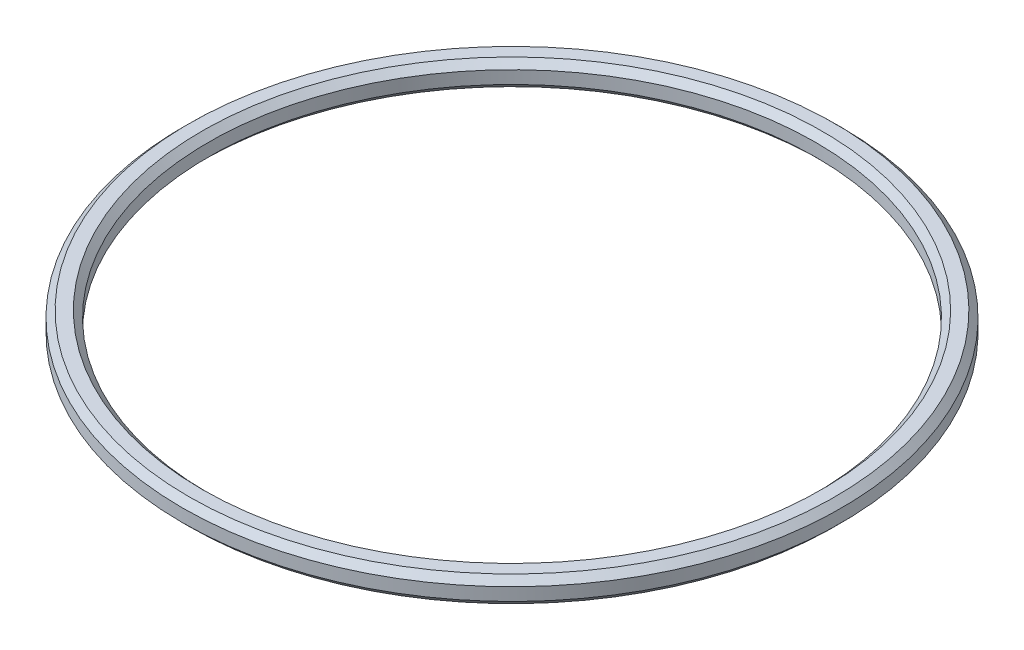
ISO-10303-21;
HEADER;
FILE_DESCRIPTION(('STEP AP214'),'2;1');
FILE_NAME('part.step','',(''),(''),'','','');
FILE_SCHEMA(('AUTOMOTIVE_DESIGN { 1 0 10303 214 1 1 1 1 }'));
ENDSEC;
DATA;
#1=APPLICATION_CONTEXT('core data for automotive mechanical design processes');
#2=APPLICATION_PROTOCOL_DEFINITION('international standard','automotive_design',2000,#1);
#3=PRODUCT_CONTEXT('',#1,'mechanical');
#4=PRODUCT('Part','Part','',(#3));
#5=PRODUCT_RELATED_PRODUCT_CATEGORY('part','',(#4));
#6=PRODUCT_DEFINITION_FORMATION('','',#4);
#7=PRODUCT_DEFINITION_CONTEXT('part definition',#1,'design');
#8=PRODUCT_DEFINITION('design','',#6,#7);
#9=PRODUCT_DEFINITION_SHAPE('','',#8);
#10=(LENGTH_UNIT() NAMED_UNIT(*) SI_UNIT(.MILLI.,.METRE.));
#11=(NAMED_UNIT(*) PLANE_ANGLE_UNIT() SI_UNIT($,.RADIAN.));
#12=(NAMED_UNIT(*) SI_UNIT($,.STERADIAN.) SOLID_ANGLE_UNIT());
#13=UNCERTAINTY_MEASURE_WITH_UNIT(LENGTH_MEASURE(1.E-05),#10,'distance_accuracy_value','');
#14=(GEOMETRIC_REPRESENTATION_CONTEXT(3) GLOBAL_UNCERTAINTY_ASSIGNED_CONTEXT((#13)) GLOBAL_UNIT_ASSIGNED_CONTEXT((#10,
#11,#12)) REPRESENTATION_CONTEXT('',''));
#15=CARTESIAN_POINT('',(0.,0.,0.));
#16=DIRECTION('',(0.,0.,1.));
#17=DIRECTION('',(1.,0.,0.));
#18=AXIS2_PLACEMENT_3D('',#15,#16,#17);
#19=CARTESIAN_POINT('',(0.,73.025,0.));
#20=DIRECTION('',(0.,1.,0.));
#21=DIRECTION('',(0.,0.,1.));
#22=AXIS2_PLACEMENT_3D('',#19,#20,#21);
#23=CYLINDRICAL_SURFACE('',#22,32.373);
#24=CARTESIAN_POINT('',(0.,73.66,0.));
#25=DIRECTION('',(0.,1.,0.));
#26=DIRECTION('',(0.,0.,1.));
#27=AXIS2_PLACEMENT_3D('',#24,#25,#26);
#28=CIRCLE('',#27,32.373);
#29=CARTESIAN_POINT('',(0.,73.66,32.373));
#30=VERTEX_POINT('',#29);
#31=EDGE_CURVE('E60',#30,#30,#28,.T.);
#32=ORIENTED_EDGE('',*,*,#31,.T.);
#33=EDGE_LOOP('',(#32));
#34=FACE_BOUND('',#33,.T.);
#35=CARTESIAN_POINT('',(0.,74.915,0.));
#36=DIRECTION('',(0.,1.,0.));
#37=DIRECTION('',(0.,0.,1.));
#38=AXIS2_PLACEMENT_3D('',#35,#36,#37);
#39=CIRCLE('',#38,32.373);
#40=CARTESIAN_POINT('',(0.,74.915,32.373));
#41=VERTEX_POINT('',#40);
#42=EDGE_CURVE('E63',#41,#41,#39,.F.);
#43=ORIENTED_EDGE('',*,*,#42,.T.);
#44=EDGE_LOOP('',(#43));
#45=FACE_BOUND('',#44,.T.);
#46=ADVANCED_FACE('F33',(#34,#45),#23,.T.);
#47=CARTESIAN_POINT('',(0.,73.025,0.));
#48=DIRECTION('',(0.,1.,0.));
#49=DIRECTION('',(0.,0.,1.));
#50=AXIS2_PLACEMENT_3D('',#47,#48,#49);
#51=PLANE('',#50);
#52=CARTESIAN_POINT('',(0.,73.025,0.));
#53=DIRECTION('',(0.,1.,0.));
#54=DIRECTION('',(0.,0.,1.));
#55=AXIS2_PLACEMENT_3D('',#52,#53,#54);
#56=CIRCLE('',#55,31.738);
#57=CARTESIAN_POINT('',(0.,73.025,31.738));
#58=VERTEX_POINT('',#57);
#59=EDGE_CURVE('E54',#58,#58,#56,.F.);
#60=ORIENTED_EDGE('',*,*,#59,.T.);
#61=EDGE_LOOP('',(#60));
#62=FACE_BOUND('',#61,.T.);
#63=CARTESIAN_POINT('',(0.,73.025,0.));
#64=DIRECTION('',(0.,1.,0.));
#65=DIRECTION('',(0.,0.,1.));
#66=AXIS2_PLACEMENT_3D('',#63,#64,#65);
#67=CIRCLE('',#66,30.468);
#68=CARTESIAN_POINT('',(0.,73.025,30.468));
#69=VERTEX_POINT('',#68);
#70=EDGE_CURVE('E57',#69,#69,#67,.T.);
#71=ORIENTED_EDGE('',*,*,#70,.T.);
#72=EDGE_LOOP('',(#71));
#73=FACE_BOUND('',#72,.T.);
#74=ADVANCED_FACE('F82',(#62,#73),#51,.F.);
#75=CARTESIAN_POINT('',(0.,75.55,0.));
#76=DIRECTION('',(0.,1.,0.));
#77=DIRECTION('',(0.,0.,1.));
#78=AXIS2_PLACEMENT_3D('',#75,#76,#77);
#79=PLANE('',#78);
#80=CARTESIAN_POINT('',(0.,75.55,0.));
#81=DIRECTION('',(0.,1.,0.));
#82=DIRECTION('',(0.,0.,1.));
#83=AXIS2_PLACEMENT_3D('',#80,#81,#82);
#84=CIRCLE('',#83,31.738);
#85=CARTESIAN_POINT('',(0.,75.55,31.738));
#86=VERTEX_POINT('',#85);
#87=EDGE_CURVE('E10',#86,#86,#84,.T.);
#88=ORIENTED_EDGE('',*,*,#87,.T.);
#89=EDGE_LOOP('',(#88));
#90=FACE_BOUND('',#89,.T.);
#91=CARTESIAN_POINT('',(0.,75.55,0.));
#92=DIRECTION('',(0.,1.,0.));
#93=DIRECTION('',(0.,0.,1.));
#94=AXIS2_PLACEMENT_3D('',#91,#92,#93);
#95=CIRCLE('',#94,30.468);
#96=CARTESIAN_POINT('',(0.,75.55,30.468));
#97=VERTEX_POINT('',#96);
#98=EDGE_CURVE('E41',#97,#97,#95,.F.);
#99=ORIENTED_EDGE('',*,*,#98,.T.);
#100=EDGE_LOOP('',(#99));
#101=FACE_BOUND('',#100,.T.);
#102=ADVANCED_FACE('F88',(#90,#101),#79,.T.);
#103=CARTESIAN_POINT('',(0.,73.025,0.));
#104=DIRECTION('',(0.,1.,0.));
#105=DIRECTION('',(0.,0.,1.));
#106=AXIS2_PLACEMENT_3D('',#103,#104,#105);
#107=CYLINDRICAL_SURFACE('',#106,29.833);
#108=CARTESIAN_POINT('',(0.,73.66,0.));
#109=DIRECTION('',(0.,1.,0.));
#110=DIRECTION('',(0.,0.,1.));
#111=AXIS2_PLACEMENT_3D('',#108,#109,#110);
#112=CIRCLE('',#111,29.833);
#113=CARTESIAN_POINT('',(0.,73.66,29.833));
#114=VERTEX_POINT('',#113);
#115=EDGE_CURVE('E45',#114,#114,#112,.F.);
#116=ORIENTED_EDGE('',*,*,#115,.T.);
#117=EDGE_LOOP('',(#116));
#118=FACE_BOUND('',#117,.T.);
#119=CARTESIAN_POINT('',(0.,74.915,0.));
#120=DIRECTION('',(0.,1.,0.));
#121=DIRECTION('',(0.,0.,1.));
#122=AXIS2_PLACEMENT_3D('',#119,#120,#121);
#123=CIRCLE('',#122,29.833);
#124=CARTESIAN_POINT('',(0.,74.915,29.833));
#125=VERTEX_POINT('',#124);
#126=EDGE_CURVE('E49',#125,#125,#123,.T.);
#127=ORIENTED_EDGE('',*,*,#126,.T.);
#128=EDGE_LOOP('',(#127));
#129=FACE_BOUND('',#128,.T.);
#130=ADVANCED_FACE('F98',(#118,#129),#107,.F.);
#131=CARTESIAN_POINT('',(0.,73.66,0.));
#132=DIRECTION('',(0.,1.,0.));
#133=DIRECTION('',(0.,0.,1.));
#134=AXIS2_PLACEMENT_3D('',#131,#132,#133);
#135=CONICAL_SURFACE('',#134,32.373,0.785398163397443);
#136=ORIENTED_EDGE('',*,*,#59,.F.);
#137=EDGE_LOOP('',(#136));
#138=FACE_BOUND('',#137,.T.);
#139=ORIENTED_EDGE('',*,*,#31,.F.);
#140=EDGE_LOOP('',(#139));
#141=FACE_BOUND('',#140,.T.);
#142=ADVANCED_FACE('F77',(#138,#141),#135,.T.);
#143=CARTESIAN_POINT('',(0.,73.025,0.));
#144=DIRECTION('',(0.,-1.,0.));
#145=DIRECTION('',(0.,0.,-1.));
#146=AXIS2_PLACEMENT_3D('',#143,#144,#145);
#147=CONICAL_SURFACE('',#146,30.468,0.785398163397437);
#148=ORIENTED_EDGE('',*,*,#115,.F.);
#149=EDGE_LOOP('',(#148));
#150=FACE_BOUND('',#149,.T.);
#151=ORIENTED_EDGE('',*,*,#70,.F.);
#152=EDGE_LOOP('',(#151));
#153=FACE_BOUND('',#152,.T.);
#154=ADVANCED_FACE('F71',(#150,#153),#147,.F.);
#155=CARTESIAN_POINT('',(0.,75.55,0.));
#156=DIRECTION('',(0.,-1.,0.));
#157=DIRECTION('',(0.,0.,-1.));
#158=AXIS2_PLACEMENT_3D('',#155,#156,#157);
#159=CONICAL_SURFACE('',#158,31.738,0.785398163397448);
#160=ORIENTED_EDGE('',*,*,#42,.F.);
#161=EDGE_LOOP('',(#160));
#162=FACE_BOUND('',#161,.T.);
#163=ORIENTED_EDGE('',*,*,#87,.F.);
#164=EDGE_LOOP('',(#163));
#165=FACE_BOUND('',#164,.T.);
#166=ADVANCED_FACE('F68',(#162,#165),#159,.T.);
#167=CARTESIAN_POINT('',(0.,74.915,0.));
#168=DIRECTION('',(0.,1.,0.));
#169=DIRECTION('',(0.,0.,1.));
#170=AXIS2_PLACEMENT_3D('',#167,#168,#169);
#171=CONICAL_SURFACE('',#170,29.833,0.785398163397437);
#172=ORIENTED_EDGE('',*,*,#98,.F.);
#173=EDGE_LOOP('',(#172));
#174=FACE_BOUND('',#173,.T.);
#175=ORIENTED_EDGE('',*,*,#126,.F.);
#176=EDGE_LOOP('',(#175));
#177=FACE_BOUND('',#176,.T.);
#178=ADVANCED_FACE('F36',(#174,#177),#171,.F.);
#179=CLOSED_SHELL('',(#46,#74,#102,#130,#142,#154,#166,#178));
#180=MANIFOLD_SOLID_BREP('B2',#179);
#181=ADVANCED_BREP_SHAPE_REPRESENTATION('',(#18,#180),#14);
#182=SHAPE_DEFINITION_REPRESENTATION(#9,#181);
ENDSEC;
END-ISO-10303-21;
